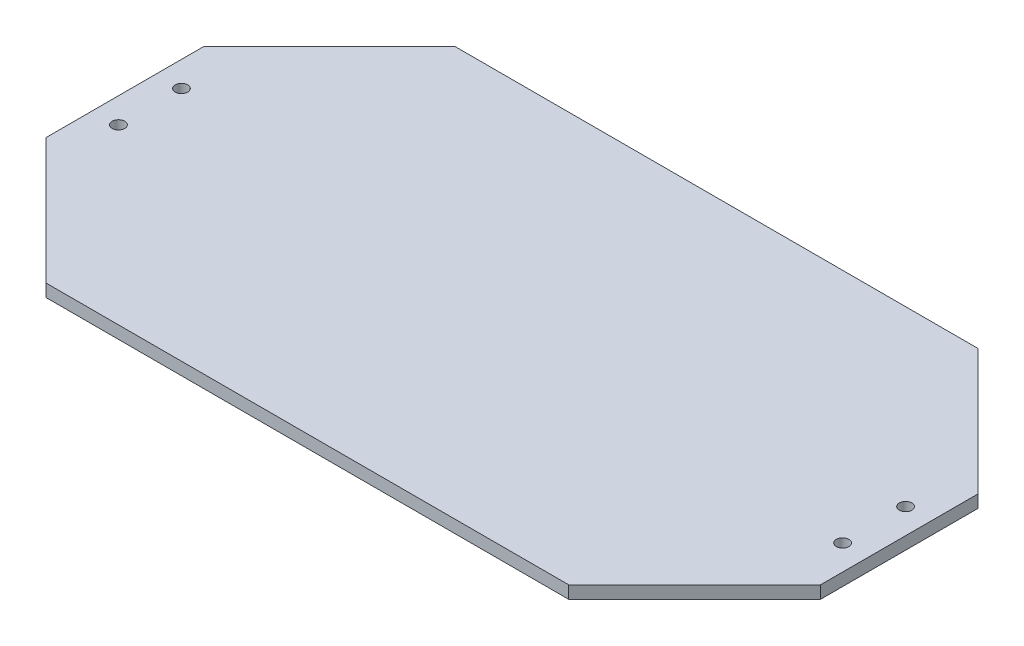
ISO-10303-21;
HEADER;
FILE_DESCRIPTION(('STEP AP214'),'2;1');
FILE_NAME('part.step','',(''),(''),'','','');
FILE_SCHEMA(('AUTOMOTIVE_DESIGN { 1 0 10303 214 1 1 1 1 }'));
ENDSEC;
DATA;
#1=APPLICATION_CONTEXT('core data for automotive mechanical design processes');
#2=APPLICATION_PROTOCOL_DEFINITION('international standard','automotive_design',2000,#1);
#3=PRODUCT_CONTEXT('',#1,'mechanical');
#4=PRODUCT('Part','Part','',(#3));
#5=PRODUCT_RELATED_PRODUCT_CATEGORY('part','',(#4));
#6=PRODUCT_DEFINITION_FORMATION('','',#4);
#7=PRODUCT_DEFINITION_CONTEXT('part definition',#1,'design');
#8=PRODUCT_DEFINITION('design','',#6,#7);
#9=PRODUCT_DEFINITION_SHAPE('','',#8);
#10=(LENGTH_UNIT() NAMED_UNIT(*) SI_UNIT(.MILLI.,.METRE.));
#11=(NAMED_UNIT(*) PLANE_ANGLE_UNIT() SI_UNIT($,.RADIAN.));
#12=(NAMED_UNIT(*) SI_UNIT($,.STERADIAN.) SOLID_ANGLE_UNIT());
#13=UNCERTAINTY_MEASURE_WITH_UNIT(LENGTH_MEASURE(1.E-05),#10,'distance_accuracy_value','');
#14=(GEOMETRIC_REPRESENTATION_CONTEXT(3) GLOBAL_UNCERTAINTY_ASSIGNED_CONTEXT((#13)) GLOBAL_UNIT_ASSIGNED_CONTEXT((#10,
#11,#12)) REPRESENTATION_CONTEXT('',''));
#15=CARTESIAN_POINT('',(0.,0.,0.));
#16=DIRECTION('',(0.,0.,1.));
#17=DIRECTION('',(1.,0.,0.));
#18=AXIS2_PLACEMENT_3D('',#15,#16,#17);
#19=CARTESIAN_POINT('',(0.,5.08,0.));
#20=DIRECTION('',(0.,1.,0.));
#21=DIRECTION('',(0.,0.,1.));
#22=AXIS2_PLACEMENT_3D('',#19,#20,#21);
#23=PLANE('',#22);
#24=CARTESIAN_POINT('',(292.1,5.08,-12.7));
#25=DIRECTION('',(0.,1.,0.));
#26=DIRECTION('',(0.,0.,1.));
#27=AXIS2_PLACEMENT_3D('',#24,#25,#26);
#28=CIRCLE('',#27,2.54000000000001);
#29=CARTESIAN_POINT('',(292.1,5.08,-10.16));
#30=VERTEX_POINT('',#29);
#31=EDGE_CURVE('E296',#30,#30,#28,.T.);
#32=ORIENTED_EDGE('',*,*,#31,.F.);
#33=EDGE_LOOP('',(#32));
#34=FACE_BOUND('',#33,.T.);
#35=CARTESIAN_POINT('',(0.,5.08,12.7));
#36=DIRECTION('',(0.,1.,0.));
#37=DIRECTION('',(0.,0.,1.));
#38=AXIS2_PLACEMENT_3D('',#35,#36,#37);
#39=CIRCLE('',#38,2.54);
#40=CARTESIAN_POINT('',(0.,5.08,15.24));
#41=VERTEX_POINT('',#40);
#42=EDGE_CURVE('E242',#41,#41,#39,.T.);
#43=ORIENTED_EDGE('',*,*,#42,.F.);
#44=EDGE_LOOP('',(#43));
#45=FACE_BOUND('',#44,.T.);
#46=DIRECTION('',(-0.707106781186548,0.,-0.707106781186547));
#47=VECTOR('',#46,1.);
#48=CARTESIAN_POINT('',(302.26,5.08,-31.75));
#49=LINE('',#48,#47);
#50=CARTESIAN_POINT('',(302.26,5.08,-31.75));
#51=VERTEX_POINT('',#50);
#52=CARTESIAN_POINT('',(251.46,5.08,-82.55));
#53=VERTEX_POINT('',#52);
#54=EDGE_CURVE('E253',#51,#53,#49,.T.);
#55=ORIENTED_EDGE('',*,*,#54,.T.);
#56=DIRECTION('',(-1.,0.,0.));
#57=VECTOR('',#56,1.);
#58=CARTESIAN_POINT('',(251.46,5.08,-82.55));
#59=LINE('',#58,#57);
#60=CARTESIAN_POINT('',(40.64,5.08,-82.55));
#61=VERTEX_POINT('',#60);
#62=EDGE_CURVE('E201',#53,#61,#59,.T.);
#63=ORIENTED_EDGE('',*,*,#62,.T.);
#64=DIRECTION('',(-0.707106781186548,0.,0.707106781186547));
#65=VECTOR('',#64,1.);
#66=CARTESIAN_POINT('',(40.64,5.08,-82.55));
#67=LINE('',#66,#65);
#68=CARTESIAN_POINT('',(-10.16,5.08,-31.75));
#69=VERTEX_POINT('',#68);
#70=EDGE_CURVE('E268',#61,#69,#67,.T.);
#71=ORIENTED_EDGE('',*,*,#70,.T.);
#72=DIRECTION('',(0.,0.,1.));
#73=VECTOR('',#72,1.);
#74=CARTESIAN_POINT('',(-10.16,5.08,-31.75));
#75=LINE('',#74,#73);
#76=CARTESIAN_POINT('',(-10.16,5.08,31.75));
#77=VERTEX_POINT('',#76);
#78=EDGE_CURVE('E281',#69,#77,#75,.T.);
#79=ORIENTED_EDGE('',*,*,#78,.T.);
#80=DIRECTION('',(0.707106781186548,0.,0.707106781186547));
#81=VECTOR('',#80,1.);
#82=CARTESIAN_POINT('',(-10.16,5.08,31.75));
#83=LINE('',#82,#81);
#84=CARTESIAN_POINT('',(40.64,5.08,82.55));
#85=VERTEX_POINT('',#84);
#86=EDGE_CURVE('E220',#77,#85,#83,.T.);
#87=ORIENTED_EDGE('',*,*,#86,.T.);
#88=DIRECTION('',(1.,0.,0.));
#89=VECTOR('',#88,1.);
#90=CARTESIAN_POINT('',(40.64,5.08,82.55));
#91=LINE('',#90,#89);
#92=CARTESIAN_POINT('',(251.46,5.08,82.55));
#93=VERTEX_POINT('',#92);
#94=EDGE_CURVE('E214',#85,#93,#91,.T.);
#95=ORIENTED_EDGE('',*,*,#94,.T.);
#96=DIRECTION('',(0.707106781186548,0.,-0.707106781186547));
#97=VECTOR('',#96,1.);
#98=CARTESIAN_POINT('',(251.46,5.08,82.55));
#99=LINE('',#98,#97);
#100=CARTESIAN_POINT('',(302.26,5.08,31.75));
#101=VERTEX_POINT('',#100);
#102=EDGE_CURVE('E218',#93,#101,#99,.T.);
#103=ORIENTED_EDGE('',*,*,#102,.T.);
#104=DIRECTION('',(0.,0.,-1.));
#105=VECTOR('',#104,1.);
#106=CARTESIAN_POINT('',(302.26,5.08,31.75));
#107=LINE('',#106,#105);
#108=EDGE_CURVE('E158',#101,#51,#107,.T.);
#109=ORIENTED_EDGE('',*,*,#108,.T.);
#110=EDGE_LOOP('',(#55,#63,#71,#79,#87,#95,#103,#109));
#111=FACE_BOUND('',#110,.T.);
#112=CARTESIAN_POINT('',(0.,5.08,-12.7));
#113=DIRECTION('',(0.,1.,0.));
#114=DIRECTION('',(0.,0.,1.));
#115=AXIS2_PLACEMENT_3D('',#112,#113,#114);
#116=CIRCLE('',#115,2.54);
#117=CARTESIAN_POINT('',(0.,5.08,-10.16));
#118=VERTEX_POINT('',#117);
#119=EDGE_CURVE('E290',#118,#118,#116,.T.);
#120=ORIENTED_EDGE('',*,*,#119,.F.);
#121=EDGE_LOOP('',(#120));
#122=FACE_BOUND('',#121,.T.);
#123=CARTESIAN_POINT('',(292.1,5.08,12.7));
#124=DIRECTION('',(0.,1.,0.));
#125=DIRECTION('',(0.,0.,1.));
#126=AXIS2_PLACEMENT_3D('',#123,#124,#125);
#127=CIRCLE('',#126,2.54000000000001);
#128=CARTESIAN_POINT('',(292.1,5.08,15.24));
#129=VERTEX_POINT('',#128);
#130=EDGE_CURVE('E302',#129,#129,#127,.T.);
#131=ORIENTED_EDGE('',*,*,#130,.F.);
#132=EDGE_LOOP('',(#131));
#133=FACE_BOUND('',#132,.T.);
#134=ADVANCED_FACE('F141',(#34,#45,#111,#122,#133),#23,.T.);
#135=CARTESIAN_POINT('',(0.,0.,0.));
#136=DIRECTION('',(0.,1.,0.));
#137=DIRECTION('',(0.,0.,1.));
#138=AXIS2_PLACEMENT_3D('',#135,#136,#137);
#139=PLANE('',#138);
#140=CARTESIAN_POINT('',(292.1,0.,-12.7));
#141=DIRECTION('',(0.,1.,0.));
#142=DIRECTION('',(0.,0.,1.));
#143=AXIS2_PLACEMENT_3D('',#140,#141,#142);
#144=CIRCLE('',#143,2.54000000000001);
#145=CARTESIAN_POINT('',(292.1,0.,-10.16));
#146=VERTEX_POINT('',#145);
#147=EDGE_CURVE('E299',#146,#146,#144,.T.);
#148=ORIENTED_EDGE('',*,*,#147,.T.);
#149=EDGE_LOOP('',(#148));
#150=FACE_BOUND('',#149,.T.);
#151=CARTESIAN_POINT('',(0.,0.,12.7));
#152=DIRECTION('',(0.,1.,0.));
#153=DIRECTION('',(0.,0.,1.));
#154=AXIS2_PLACEMENT_3D('',#151,#152,#153);
#155=CIRCLE('',#154,2.54);
#156=CARTESIAN_POINT('',(0.,0.,15.24));
#157=VERTEX_POINT('',#156);
#158=EDGE_CURVE('E287',#157,#157,#155,.T.);
#159=ORIENTED_EDGE('',*,*,#158,.T.);
#160=EDGE_LOOP('',(#159));
#161=FACE_BOUND('',#160,.T.);
#162=DIRECTION('',(-0.707106781186548,0.,-0.707106781186547));
#163=VECTOR('',#162,1.);
#164=CARTESIAN_POINT('',(302.26,0.,-31.75));
#165=LINE('',#164,#163);
#166=CARTESIAN_POINT('',(302.26,0.,-31.75));
#167=VERTEX_POINT('',#166);
#168=CARTESIAN_POINT('',(251.46,0.,-82.55));
#169=VERTEX_POINT('',#168);
#170=EDGE_CURVE('E238',#167,#169,#165,.T.);
#171=ORIENTED_EDGE('',*,*,#170,.F.);
#172=DIRECTION('',(0.,0.,-1.));
#173=VECTOR('',#172,1.);
#174=CARTESIAN_POINT('',(302.26,0.,31.75));
#175=LINE('',#174,#173);
#176=CARTESIAN_POINT('',(302.26,0.,31.75));
#177=VERTEX_POINT('',#176);
#178=EDGE_CURVE('E193',#177,#167,#175,.T.);
#179=ORIENTED_EDGE('',*,*,#178,.F.);
#180=DIRECTION('',(0.707106781186548,0.,-0.707106781186547));
#181=VECTOR('',#180,1.);
#182=CARTESIAN_POINT('',(251.46,0.,82.55));
#183=LINE('',#182,#181);
#184=CARTESIAN_POINT('',(251.46,0.,82.55));
#185=VERTEX_POINT('',#184);
#186=EDGE_CURVE('E187',#185,#177,#183,.T.);
#187=ORIENTED_EDGE('',*,*,#186,.F.);
#188=DIRECTION('',(1.,0.,0.));
#189=VECTOR('',#188,1.);
#190=CARTESIAN_POINT('',(40.64,0.,82.55));
#191=LINE('',#190,#189);
#192=CARTESIAN_POINT('',(40.64,0.,82.55));
#193=VERTEX_POINT('',#192);
#194=EDGE_CURVE('E228',#193,#185,#191,.T.);
#195=ORIENTED_EDGE('',*,*,#194,.F.);
#196=DIRECTION('',(0.707106781186548,0.,0.707106781186547));
#197=VECTOR('',#196,1.);
#198=CARTESIAN_POINT('',(-10.16,0.,31.75));
#199=LINE('',#198,#197);
#200=CARTESIAN_POINT('',(-10.16,0.,31.75));
#201=VERTEX_POINT('',#200);
#202=EDGE_CURVE('E248',#201,#193,#199,.T.);
#203=ORIENTED_EDGE('',*,*,#202,.F.);
#204=DIRECTION('',(0.,0.,1.));
#205=VECTOR('',#204,1.);
#206=CARTESIAN_POINT('',(-10.16,0.,-31.75));
#207=LINE('',#206,#205);
#208=CARTESIAN_POINT('',(-10.16,0.,-31.75));
#209=VERTEX_POINT('',#208);
#210=EDGE_CURVE('E246',#209,#201,#207,.T.);
#211=ORIENTED_EDGE('',*,*,#210,.F.);
#212=DIRECTION('',(-0.707106781186548,0.,0.707106781186547));
#213=VECTOR('',#212,1.);
#214=CARTESIAN_POINT('',(40.64,0.,-82.55));
#215=LINE('',#214,#213);
#216=CARTESIAN_POINT('',(40.64,0.,-82.55));
#217=VERTEX_POINT('',#216);
#218=EDGE_CURVE('E244',#217,#209,#215,.T.);
#219=ORIENTED_EDGE('',*,*,#218,.F.);
#220=DIRECTION('',(-1.,0.,0.));
#221=VECTOR('',#220,1.);
#222=CARTESIAN_POINT('',(251.46,0.,-82.55));
#223=LINE('',#222,#221);
#224=EDGE_CURVE('E241',#169,#217,#223,.T.);
#225=ORIENTED_EDGE('',*,*,#224,.F.);
#226=EDGE_LOOP('',(#171,#179,#187,#195,#203,#211,#219,#225));
#227=FACE_BOUND('',#226,.T.);
#228=CARTESIAN_POINT('',(0.,0.,-12.7));
#229=DIRECTION('',(0.,1.,0.));
#230=DIRECTION('',(0.,0.,1.));
#231=AXIS2_PLACEMENT_3D('',#228,#229,#230);
#232=CIRCLE('',#231,2.54);
#233=CARTESIAN_POINT('',(0.,0.,-10.16));
#234=VERTEX_POINT('',#233);
#235=EDGE_CURVE('E293',#234,#234,#232,.T.);
#236=ORIENTED_EDGE('',*,*,#235,.T.);
#237=EDGE_LOOP('',(#236));
#238=FACE_BOUND('',#237,.T.);
#239=CARTESIAN_POINT('',(292.1,0.,12.7));
#240=DIRECTION('',(0.,1.,0.));
#241=DIRECTION('',(0.,0.,1.));
#242=AXIS2_PLACEMENT_3D('',#239,#240,#241);
#243=CIRCLE('',#242,2.54000000000001);
#244=CARTESIAN_POINT('',(292.1,0.,15.24));
#245=VERTEX_POINT('',#244);
#246=EDGE_CURVE('E305',#245,#245,#243,.T.);
#247=ORIENTED_EDGE('',*,*,#246,.T.);
#248=EDGE_LOOP('',(#247));
#249=FACE_BOUND('',#248,.T.);
#250=ADVANCED_FACE('F272',(#150,#161,#227,#238,#249),#139,.F.);
#251=CARTESIAN_POINT('',(302.26,5.08,-31.75));
#252=DIRECTION('',(-0.707106781186547,0.,0.707106781186548));
#253=DIRECTION('',(0.707106781186548,0.,0.707106781186547));
#254=AXIS2_PLACEMENT_3D('',#251,#252,#253);
#255=PLANE('',#254);
#256=ORIENTED_EDGE('',*,*,#170,.T.);
#257=DIRECTION('',(0.,-1.,0.));
#258=VECTOR('',#257,1.);
#259=CARTESIAN_POINT('',(251.46,5.08,-82.55));
#260=LINE('',#259,#258);
#261=EDGE_CURVE('E12',#53,#169,#260,.T.);
#262=ORIENTED_EDGE('',*,*,#261,.F.);
#263=ORIENTED_EDGE('',*,*,#54,.F.);
#264=DIRECTION('',(0.,-1.,0.));
#265=VECTOR('',#264,1.);
#266=CARTESIAN_POINT('',(302.26,5.08,-31.75));
#267=LINE('',#266,#265);
#268=EDGE_CURVE('E234',#51,#167,#267,.T.);
#269=ORIENTED_EDGE('',*,*,#268,.T.);
#270=EDGE_LOOP('',(#256,#262,#263,#269));
#271=FACE_BOUND('',#270,.T.);
#272=ADVANCED_FACE('F143',(#271),#255,.F.);
#273=CARTESIAN_POINT('',(251.46,5.08,-82.55));
#274=DIRECTION('',(0.,0.,1.));
#275=DIRECTION('',(1.,0.,0.));
#276=AXIS2_PLACEMENT_3D('',#273,#274,#275);
#277=PLANE('',#276);
#278=ORIENTED_EDGE('',*,*,#224,.T.);
#279=DIRECTION('',(0.,-1.,0.));
#280=VECTOR('',#279,1.);
#281=CARTESIAN_POINT('',(40.64,5.08,-82.55));
#282=LINE('',#281,#280);
#283=EDGE_CURVE('E150',#61,#217,#282,.T.);
#284=ORIENTED_EDGE('',*,*,#283,.F.);
#285=ORIENTED_EDGE('',*,*,#62,.F.);
#286=ORIENTED_EDGE('',*,*,#261,.T.);
#287=EDGE_LOOP('',(#278,#284,#285,#286));
#288=FACE_BOUND('',#287,.T.);
#289=ADVANCED_FACE('F340',(#288),#277,.F.);
#290=CARTESIAN_POINT('',(40.64,5.08,-82.55));
#291=DIRECTION('',(0.707106781186547,0.,0.707106781186548));
#292=DIRECTION('',(0.707106781186548,0.,-0.707106781186547));
#293=AXIS2_PLACEMENT_3D('',#290,#291,#292);
#294=PLANE('',#293);
#295=ORIENTED_EDGE('',*,*,#218,.T.);
#296=DIRECTION('',(0.,-1.,0.));
#297=VECTOR('',#296,1.);
#298=CARTESIAN_POINT('',(-10.16,5.08,-31.75));
#299=LINE('',#298,#297);
#300=EDGE_CURVE('E260',#69,#209,#299,.T.);
#301=ORIENTED_EDGE('',*,*,#300,.F.);
#302=ORIENTED_EDGE('',*,*,#70,.F.);
#303=ORIENTED_EDGE('',*,*,#283,.T.);
#304=EDGE_LOOP('',(#295,#301,#302,#303));
#305=FACE_BOUND('',#304,.T.);
#306=ADVANCED_FACE('F266',(#305),#294,.F.);
#307=CARTESIAN_POINT('',(-10.16,5.08,-31.75));
#308=DIRECTION('',(1.,0.,0.));
#309=DIRECTION('',(0.,0.,-1.));
#310=AXIS2_PLACEMENT_3D('',#307,#308,#309);
#311=PLANE('',#310);
#312=ORIENTED_EDGE('',*,*,#210,.T.);
#313=DIRECTION('',(0.,-1.,0.));
#314=VECTOR('',#313,1.);
#315=CARTESIAN_POINT('',(-10.16,5.08,31.75));
#316=LINE('',#315,#314);
#317=EDGE_CURVE('E257',#77,#201,#316,.T.);
#318=ORIENTED_EDGE('',*,*,#317,.F.);
#319=ORIENTED_EDGE('',*,*,#78,.F.);
#320=ORIENTED_EDGE('',*,*,#300,.T.);
#321=EDGE_LOOP('',(#312,#318,#319,#320));
#322=FACE_BOUND('',#321,.T.);
#323=ADVANCED_FACE('F277',(#322),#311,.F.);
#324=CARTESIAN_POINT('',(-10.16,5.08,31.75));
#325=DIRECTION('',(0.707106781186547,0.,-0.707106781186548));
#326=DIRECTION('',(-0.707106781186548,0.,-0.707106781186547));
#327=AXIS2_PLACEMENT_3D('',#324,#325,#326);
#328=PLANE('',#327);
#329=ORIENTED_EDGE('',*,*,#202,.T.);
#330=DIRECTION('',(0.,-1.,0.));
#331=VECTOR('',#330,1.);
#332=CARTESIAN_POINT('',(40.64,5.08,82.55));
#333=LINE('',#332,#331);
#334=EDGE_CURVE('E229',#85,#193,#333,.T.);
#335=ORIENTED_EDGE('',*,*,#334,.F.);
#336=ORIENTED_EDGE('',*,*,#86,.F.);
#337=ORIENTED_EDGE('',*,*,#317,.T.);
#338=EDGE_LOOP('',(#329,#335,#336,#337));
#339=FACE_BOUND('',#338,.T.);
#340=ADVANCED_FACE('F280',(#339),#328,.F.);
#341=CARTESIAN_POINT('',(40.64,5.08,82.55));
#342=DIRECTION('',(0.,0.,-1.));
#343=DIRECTION('',(-1.,0.,0.));
#344=AXIS2_PLACEMENT_3D('',#341,#342,#343);
#345=PLANE('',#344);
#346=ORIENTED_EDGE('',*,*,#194,.T.);
#347=DIRECTION('',(0.,-1.,0.));
#348=VECTOR('',#347,1.);
#349=CARTESIAN_POINT('',(251.46,5.08,82.55));
#350=LINE('',#349,#348);
#351=EDGE_CURVE('E225',#93,#185,#350,.T.);
#352=ORIENTED_EDGE('',*,*,#351,.F.);
#353=ORIENTED_EDGE('',*,*,#94,.F.);
#354=ORIENTED_EDGE('',*,*,#334,.T.);
#355=EDGE_LOOP('',(#346,#352,#353,#354));
#356=FACE_BOUND('',#355,.T.);
#357=ADVANCED_FACE('F226',(#356),#345,.F.);
#358=CARTESIAN_POINT('',(251.46,5.08,82.55));
#359=DIRECTION('',(-0.707106781186547,0.,-0.707106781186548));
#360=DIRECTION('',(-0.707106781186548,0.,0.707106781186547));
#361=AXIS2_PLACEMENT_3D('',#358,#359,#360);
#362=PLANE('',#361);
#363=ORIENTED_EDGE('',*,*,#186,.T.);
#364=DIRECTION('',(0.,-1.,0.));
#365=VECTOR('',#364,1.);
#366=CARTESIAN_POINT('',(302.26,5.08,31.75));
#367=LINE('',#366,#365);
#368=EDGE_CURVE('E230',#101,#177,#367,.T.);
#369=ORIENTED_EDGE('',*,*,#368,.F.);
#370=ORIENTED_EDGE('',*,*,#102,.F.);
#371=ORIENTED_EDGE('',*,*,#351,.T.);
#372=EDGE_LOOP('',(#363,#369,#370,#371));
#373=FACE_BOUND('',#372,.T.);
#374=ADVANCED_FACE('F232',(#373),#362,.F.);
#375=CARTESIAN_POINT('',(302.26,5.08,31.75));
#376=DIRECTION('',(-1.,0.,0.));
#377=DIRECTION('',(0.,0.,1.));
#378=AXIS2_PLACEMENT_3D('',#375,#376,#377);
#379=PLANE('',#378);
#380=ORIENTED_EDGE('',*,*,#178,.T.);
#381=ORIENTED_EDGE('',*,*,#268,.F.);
#382=ORIENTED_EDGE('',*,*,#108,.F.);
#383=ORIENTED_EDGE('',*,*,#368,.T.);
#384=EDGE_LOOP('',(#380,#381,#382,#383));
#385=FACE_BOUND('',#384,.T.);
#386=ADVANCED_FACE('F328',(#385),#379,.F.);
#387=CARTESIAN_POINT('',(0.,5.08,12.7));
#388=DIRECTION('',(0.,-1.,0.));
#389=DIRECTION('',(0.,0.,-1.));
#390=AXIS2_PLACEMENT_3D('',#387,#388,#389);
#391=CYLINDRICAL_SURFACE('',#390,2.54);
#392=ORIENTED_EDGE('',*,*,#42,.T.);
#393=EDGE_LOOP('',(#392));
#394=FACE_BOUND('',#393,.T.);
#395=ORIENTED_EDGE('',*,*,#158,.F.);
#396=EDGE_LOOP('',(#395));
#397=FACE_BOUND('',#396,.T.);
#398=ADVANCED_FACE('F325',(#394,#397),#391,.F.);
#399=CARTESIAN_POINT('',(0.,5.08,-12.7));
#400=DIRECTION('',(0.,-1.,0.));
#401=DIRECTION('',(0.,0.,-1.));
#402=AXIS2_PLACEMENT_3D('',#399,#400,#401);
#403=CYLINDRICAL_SURFACE('',#402,2.54);
#404=ORIENTED_EDGE('',*,*,#119,.T.);
#405=EDGE_LOOP('',(#404));
#406=FACE_BOUND('',#405,.T.);
#407=ORIENTED_EDGE('',*,*,#235,.F.);
#408=EDGE_LOOP('',(#407));
#409=FACE_BOUND('',#408,.T.);
#410=ADVANCED_FACE('F404',(#406,#409),#403,.F.);
#411=CARTESIAN_POINT('',(292.1,5.08,-12.7));
#412=DIRECTION('',(0.,-1.,0.));
#413=DIRECTION('',(0.,0.,-1.));
#414=AXIS2_PLACEMENT_3D('',#411,#412,#413);
#415=CYLINDRICAL_SURFACE('',#414,2.54000000000001);
#416=ORIENTED_EDGE('',*,*,#31,.T.);
#417=EDGE_LOOP('',(#416));
#418=FACE_BOUND('',#417,.T.);
#419=ORIENTED_EDGE('',*,*,#147,.F.);
#420=EDGE_LOOP('',(#419));
#421=FACE_BOUND('',#420,.T.);
#422=ADVANCED_FACE('F412',(#418,#421),#415,.F.);
#423=CARTESIAN_POINT('',(292.1,5.08,12.7));
#424=DIRECTION('',(0.,-1.,0.));
#425=DIRECTION('',(0.,0.,-1.));
#426=AXIS2_PLACEMENT_3D('',#423,#424,#425);
#427=CYLINDRICAL_SURFACE('',#426,2.54000000000001);
#428=ORIENTED_EDGE('',*,*,#130,.T.);
#429=EDGE_LOOP('',(#428));
#430=FACE_BOUND('',#429,.T.);
#431=ORIENTED_EDGE('',*,*,#246,.F.);
#432=EDGE_LOOP('',(#431));
#433=FACE_BOUND('',#432,.T.);
#434=ADVANCED_FACE('F311',(#430,#433),#427,.F.);
#435=CLOSED_SHELL('',(#134,#250,#272,#289,#306,#323,#340,#357,#374,#386,#398,#410,#422,#434));
#436=MANIFOLD_SOLID_BREP('B2',#435);
#437=ADVANCED_BREP_SHAPE_REPRESENTATION('',(#18,#436),#14);
#438=SHAPE_DEFINITION_REPRESENTATION(#9,#437);
ENDSEC;
END-ISO-10303-21;
